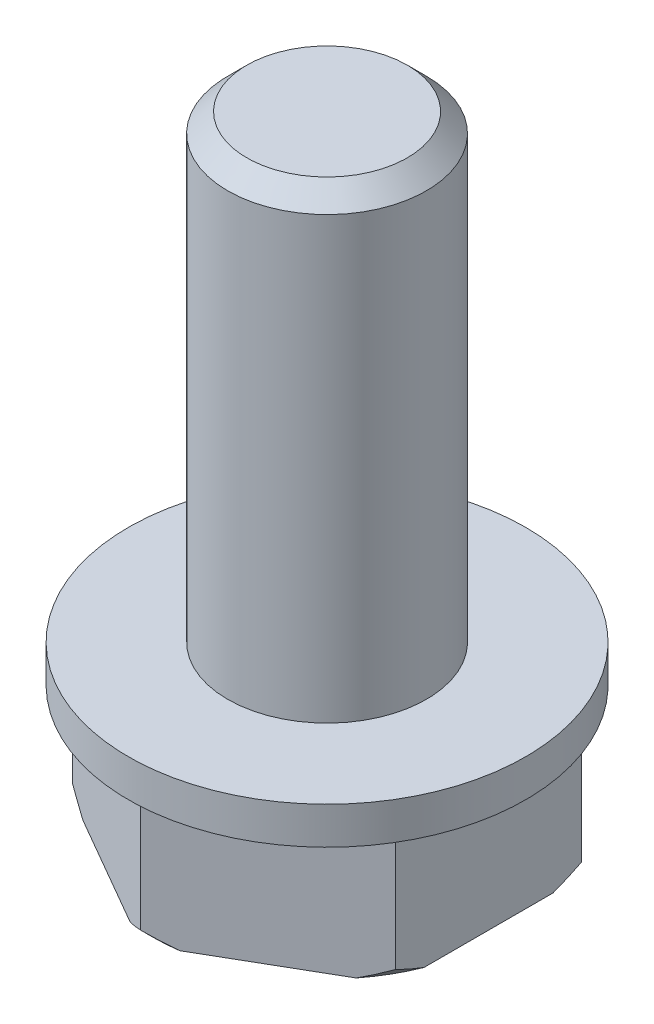
ISO-10303-21;
HEADER;
FILE_DESCRIPTION(('STEP AP214'),'2;1');
FILE_NAME('part.step','',(''),(''),'','','');
FILE_SCHEMA(('AUTOMOTIVE_DESIGN { 1 0 10303 214 1 1 1 1 }'));
ENDSEC;
DATA;
#1=APPLICATION_CONTEXT('core data for automotive mechanical design processes');
#2=APPLICATION_PROTOCOL_DEFINITION('international standard','automotive_design',2000,#1);
#3=PRODUCT_CONTEXT('',#1,'mechanical');
#4=PRODUCT('Part','Part','',(#3));
#5=PRODUCT_RELATED_PRODUCT_CATEGORY('part','',(#4));
#6=PRODUCT_DEFINITION_FORMATION('','',#4);
#7=PRODUCT_DEFINITION_CONTEXT('part definition',#1,'design');
#8=PRODUCT_DEFINITION('design','',#6,#7);
#9=PRODUCT_DEFINITION_SHAPE('','',#8);
#10=(LENGTH_UNIT() NAMED_UNIT(*) SI_UNIT(.MILLI.,.METRE.));
#11=(NAMED_UNIT(*) PLANE_ANGLE_UNIT() SI_UNIT($,.RADIAN.));
#12=(NAMED_UNIT(*) SI_UNIT($,.STERADIAN.) SOLID_ANGLE_UNIT());
#13=UNCERTAINTY_MEASURE_WITH_UNIT(LENGTH_MEASURE(1.E-05),#10,'distance_accuracy_value','');
#14=(GEOMETRIC_REPRESENTATION_CONTEXT(3) GLOBAL_UNCERTAINTY_ASSIGNED_CONTEXT((#13)) GLOBAL_UNIT_ASSIGNED_CONTEXT((#10,
#11,#12)) REPRESENTATION_CONTEXT('',''));
#15=CARTESIAN_POINT('',(0.,0.,0.));
#16=DIRECTION('',(0.,0.,1.));
#17=DIRECTION('',(1.,0.,0.));
#18=AXIS2_PLACEMENT_3D('',#15,#16,#17);
#19=CARTESIAN_POINT('',(31.2487373415292,113.4,20.9959605917966));
#20=DIRECTION('',(-0.5,0.,0.866025403784439));
#21=DIRECTION('',(0.866025403784439,0.,0.5));
#22=AXIS2_PLACEMENT_3D('',#19,#20,#21);
#23=PLANE('',#22);
#24=DIRECTION('',(0.,-1.,0.));
#25=VECTOR('',#24,1.);
#26=CARTESIAN_POINT('',(31.2487373415292,113.4,20.9959605917966));
#27=LINE('',#26,#25);
#28=CARTESIAN_POINT('',(31.2487373415292,68.7,20.9959605917966));
#29=VERTEX_POINT('',#28);
#30=CARTESIAN_POINT('',(31.2487373415292,63.9055534994651,20.9959605917966));
#31=VERTEX_POINT('',#30);
#32=EDGE_CURVE('E11',#29,#31,#27,.T.);
#33=ORIENTED_EDGE('',*,*,#32,.T.);
#34=CARTESIAN_POINT('',(30.2487373415292,63.4,20.418610322607));
#35=CARTESIAN_POINT('',(30.2898871786535,63.4176356350764,20.4423683487996));
#36=CARTESIAN_POINT('',(30.3309185698522,63.4356367332046,20.466059223998));
#37=CARTESIAN_POINT('',(30.4131261080462,63.4725093452912,20.5135255035906));
#38=CARTESIAN_POINT('',(30.4543000527066,63.491387396993,20.5372996452214));
#39=CARTESIAN_POINT('',(30.5368134585381,63.5300136187559,20.58494289067));
#40=CARTESIAN_POINT('',(30.5781505543364,63.5497685285904,20.6088106227115));
#41=CARTESIAN_POINT('',(30.6610101371074,63.5901483001101,20.6566518801523));
#42=CARTESIAN_POINT('',(30.7025301099427,63.6107800529027,20.6806239409595));
#43=CARTESIAN_POINT('',(30.7857742143479,63.6529133663717,20.7286845680958));
#44=CARTESIAN_POINT('',(30.8274956955541,63.6744219220571,20.7527715894061));
#45=CARTESIAN_POINT('',(30.9111605932301,63.7183087773034,20.8010727907276));
#46=CARTESIAN_POINT('',(30.9531012369611,63.7406941334488,20.8252853590476));
#47=CARTESIAN_POINT('',(31.037221231282,63.7863344571394,20.8738481173586));
#48=CARTESIAN_POINT('',(31.0793977002766,63.8095965033679,20.8981966416392));
#49=CARTESIAN_POINT('',(31.164005290327,63.8569905234084,20.9470416600006));
#50=CARTESIAN_POINT('',(31.2064334361144,63.8811295690813,20.9715364479081));
#51=CARTESIAN_POINT('',(31.2487373415291,63.9055534994651,20.9959605917966));
#52=B_SPLINE_CURVE_WITH_KNOTS('',3,(#34,#35,#36,#37,#38,#39,#40,#41,#42,#43,#44,#45,#46,#47,#48,
#49,#50,#51),.UNSPECIFIED.,.F.,.F.,(4,2,2,2,2,2,2,2,4),(0.,0.15204686609259,0.305507708751331,
0.460480357340248,0.617058082843109,0.775329645183755,0.93537936156832,1.0972871929665,
1.26112884592903),.UNSPECIFIED.);
#53=CARTESIAN_POINT('',(30.2487373415292,63.4,20.4186103226069));
#54=VERTEX_POINT('',#53);
#55=EDGE_CURVE('E89',#54,#31,#52,.T.);
#56=ORIENTED_EDGE('',*,*,#55,.F.);
#57=DIRECTION('',(0.866025403784439,0.,0.5));
#58=VECTOR('',#57,1.);
#59=CARTESIAN_POINT('',(33.2487373415291,63.4,22.1506611301759));
#60=LINE('',#59,#58);
#61=CARTESIAN_POINT('',(25.7487373415292,63.4,17.8205341112537));
#62=VERTEX_POINT('',#61);
#63=EDGE_CURVE('E230',#62,#54,#60,.T.);
#64=ORIENTED_EDGE('',*,*,#63,.F.);
#65=CARTESIAN_POINT('',(24.7487373415291,63.9055534994651,17.243183842064));
#66=CARTESIAN_POINT('',(24.7910412233096,63.8811295690813,17.2676080268882));
#67=CARTESIAN_POINT('',(24.8334684047916,63.8569905234084,17.2921044850218));
#68=CARTESIAN_POINT('',(24.9180732265661,63.8095965033679,17.3409542981778));
#69=CARTESIAN_POINT('',(24.9602479016351,63.7863344571393,17.3653059296288));
#70=CARTESIAN_POINT('',(25.0443644811706,63.7406941334488,17.4138746025213));
#71=CARTESIAN_POINT('',(25.0863035022922,63.7183087773034,17.4380899812835));
#72=CARTESIAN_POINT('',(25.1699660185079,63.674421922057,17.4863953074152));
#73=CARTESIAN_POINT('',(25.2116867314672,63.6529133663717,17.5104836593681));
#74=CARTESIAN_POINT('',(25.2949305076916,63.6107800529027,17.5585448549301));
#75=CARTESIAN_POINT('',(25.3364509077494,63.5901483001101,17.5825161757663));
#76=CARTESIAN_POINT('',(25.4193124434277,63.5497685285904,17.6303540506726));
#77=CARTESIAN_POINT('',(25.4606510536055,63.5300136187559,17.6542191597318));
#78=CARTESIAN_POINT('',(25.5431680173984,63.4913873969929,17.7018562426104));
#79=CARTESIAN_POINT('',(25.584344000334,63.4725093452912,17.7256268538449));
#80=CARTESIAN_POINT('',(25.6665547733813,63.4356367332046,17.7730875305072));
#81=CARTESIAN_POINT('',(25.7075873687404,63.4176356350764,17.7967763200387));
#82=CARTESIAN_POINT('',(25.7487373415291,63.4,17.8205341112537));
#83=B_SPLINE_CURVE_WITH_KNOTS('',3,(#65,#66,#67,#68,#69,#70,#71,#72,#73,#74,#75,#76,#77,#78,#79,
#80,#81,#82),.UNSPECIFIED.,.F.,.F.,(4,2,2,2,2,2,2,2,4),(0.,0.163841652962564,0.325749484360772,
0.485799200745352,0.644070763086002,0.800648488588861,0.955621137177764,1.10908197983649,
1.26112884592904),.UNSPECIFIED.);
#84=CARTESIAN_POINT('',(24.7487373415292,63.9055534994651,17.243183842064));
#85=VERTEX_POINT('',#84);
#86=EDGE_CURVE('E130',#85,#62,#83,.T.);
#87=ORIENTED_EDGE('',*,*,#86,.F.);
#88=DIRECTION('',(0.,-1.,0.));
#89=VECTOR('',#88,1.);
#90=CARTESIAN_POINT('',(24.7487373415292,113.4,17.243183842064));
#91=LINE('',#90,#89);
#92=CARTESIAN_POINT('',(24.7487373415292,68.7,17.243183842064));
#93=VERTEX_POINT('',#92);
#94=EDGE_CURVE('E215',#93,#85,#91,.T.);
#95=ORIENTED_EDGE('',*,*,#94,.F.);
#96=DIRECTION('',(-0.866025403784439,0.,-0.5));
#97=VECTOR('',#96,1.);
#98=CARTESIAN_POINT('',(30.9987373415292,68.7,20.8516230244992));
#99=LINE('',#98,#97);
#100=EDGE_CURVE('E134',#29,#93,#99,.T.);
#101=ORIENTED_EDGE('',*,*,#100,.F.);
#102=EDGE_LOOP('',(#33,#56,#64,#87,#95,#101));
#103=FACE_BOUND('',#102,.T.);
#104=ADVANCED_FACE('F16',(#103),#23,.F.);
#105=CARTESIAN_POINT('',(31.2487373415292,113.4,28.5015140912618));
#106=DIRECTION('',(-1.,0.,0.));
#107=DIRECTION('',(0.,0.,1.));
#108=AXIS2_PLACEMENT_3D('',#105,#106,#107);
#109=PLANE('',#108);
#110=DIRECTION('',(0.,-1.,0.));
#111=VECTOR('',#110,1.);
#112=CARTESIAN_POINT('',(31.2487373415292,113.4,28.5015140912618));
#113=LINE('',#112,#111);
#114=CARTESIAN_POINT('',(31.2487373415292,68.7,28.5015140912618));
#115=VERTEX_POINT('',#114);
#116=CARTESIAN_POINT('',(31.2487373415292,63.9055534994651,28.5015140912618));
#117=VERTEX_POINT('',#116);
#118=EDGE_CURVE('E126',#115,#117,#113,.T.);
#119=ORIENTED_EDGE('',*,*,#118,.T.);
#120=CARTESIAN_POINT('',(31.2487373415291,63.4,27.3468135528825));
#121=CARTESIAN_POINT('',(31.2487372058647,63.4176356350764,27.39432937029));
#122=CARTESIAN_POINT('',(31.2487360017043,63.4356367332046,27.4417090350199));
#123=CARTESIAN_POINT('',(31.248732766851,63.4725093452911,27.5366359912748));
#124=CARTESIAN_POINT('',(31.2487307285758,63.4913873969929,27.5841807441401));
#125=CARTESIAN_POINT('',(31.2487271706144,63.5300136187559,27.6794610724672));
#126=CARTESIAN_POINT('',(31.2487256562348,63.5497685285904,27.727193913568));
#127=CARTESIAN_POINT('',(31.2487237033276,63.59014830011,27.8228730459151));
#128=CARTESIAN_POINT('',(31.2487232761051,63.6107800529026,27.8708164275585));
#129=CARTESIAN_POINT('',(31.2487236042859,63.6529133663716,27.9669382502568));
#130=CARTESIAN_POINT('',(31.2487243725327,63.674421922057,28.01511362352));
#131=CARTESIAN_POINT('',(31.248726753993,63.7183087773034,28.1117201509732));
#132=CARTESIAN_POINT('',(31.2487283766026,63.7406941334487,28.1601480980554));
#133=CARTESIAN_POINT('',(31.2487317913879,63.7863344571393,28.2572795292589));
#134=CARTESIAN_POINT('',(31.2487335853135,63.8095965033678,28.3059796849905));
#135=CARTESIAN_POINT('',(31.2487363535894,63.8569905234084,28.4036745165079));
#136=CARTESIAN_POINT('',(31.2487373178949,63.8811295690813,28.452665762549));
#137=CARTESIAN_POINT('',(31.2487373415292,63.9055534994651,28.5015140912617));
#138=B_SPLINE_CURVE_WITH_KNOTS('',3,(#120,#121,#122,#123,#124,#125,#126,#127,#128,#129,#130,
#131,#132,#133,#134,#135,#136,#137),.UNSPECIFIED.,.F.,.F.,(4,2,2,2,2,2,2,2,4),(0.,
0.152046866092544,0.30550770875125,0.460480357340149,0.617058082843005,0.775329645183666,
0.935379361568245,1.09728719296646,1.26112884592904),.UNSPECIFIED.);
#139=CARTESIAN_POINT('',(31.2487373415292,63.4,27.3468135528825));
#140=VERTEX_POINT('',#139);
#141=EDGE_CURVE('E29',#140,#117,#138,.T.);
#142=ORIENTED_EDGE('',*,*,#141,.F.);
#143=DIRECTION('',(0.,0.,1.));
#144=VECTOR('',#143,1.);
#145=CARTESIAN_POINT('',(31.2487373415292,63.4,24.7487373415292));
#146=LINE('',#145,#144);
#147=CARTESIAN_POINT('',(31.2487373415292,63.4,22.1506611301759));
#148=VERTEX_POINT('',#147);
#149=EDGE_CURVE('E467',#148,#140,#146,.T.);
#150=ORIENTED_EDGE('',*,*,#149,.F.);
#151=CARTESIAN_POINT('',(31.2487373415292,63.9055534994651,20.9959605917966));
#152=CARTESIAN_POINT('',(31.2487373415292,63.7175987189877,21.3718701527514));
#153=CARTESIAN_POINT('',(31.2487373415292,63.5456736196058,21.7581725138741));
#154=CARTESIAN_POINT('',(31.2487373415292,63.4,22.1506611301759));
#155=(BOUNDED_CURVE() B_SPLINE_CURVE(3,(#151,#152,#153,#154),.UNSPECIFIED.,.F.,
.F.) B_SPLINE_CURVE_WITH_KNOTS((4,4),(0.00544471025563386,0.00669711306648936),
.UNSPECIFIED.) CURVE() GEOMETRIC_REPRESENTATION_ITEM() RATIONAL_B_SPLINE_CURVE((1.,1.,1.,1.)) REPRESENTATION_ITEM(''));
#156=EDGE_CURVE('E94',#31,#148,#155,.T.);
#157=ORIENTED_EDGE('',*,*,#156,.F.);
#158=ORIENTED_EDGE('',*,*,#32,.F.);
#159=DIRECTION('',(0.,0.,-1.));
#160=VECTOR('',#159,1.);
#161=CARTESIAN_POINT('',(31.2487373415292,68.7,24.7487373415292));
#162=LINE('',#161,#160);
#163=EDGE_CURVE('E115',#115,#29,#162,.T.);
#164=ORIENTED_EDGE('',*,*,#163,.F.);
#165=EDGE_LOOP('',(#119,#142,#150,#157,#158,#164));
#166=FACE_BOUND('',#165,.T.);
#167=ADVANCED_FACE('F151',(#166),#109,.F.);
#168=CARTESIAN_POINT('',(24.7487373415292,64.2,24.7487373415292));
#169=DIRECTION('',(0.,1.,0.));
#170=DIRECTION('',(0.,0.,1.));
#171=AXIS2_PLACEMENT_3D('',#168,#169,#170);
#172=CONICAL_SURFACE('',#171,7.8,0.785398163397448);
#173=CARTESIAN_POINT('',(24.7487373415292,63.4,24.7487373415292));
#174=DIRECTION('',(0.,-1.,0.));
#175=DIRECTION('',(0.,0.,-1.));
#176=AXIS2_PLACEMENT_3D('',#173,#174,#175);
#177=CIRCLE('',#176,7.);
#178=CARTESIAN_POINT('',(30.2487373415292,63.4,29.0788643604513));
#179=VERTEX_POINT('',#178);
#180=EDGE_CURVE('E341',#140,#179,#177,.T.);
#181=ORIENTED_EDGE('',*,*,#180,.F.);
#182=ORIENTED_EDGE('',*,*,#141,.T.);
#183=CARTESIAN_POINT('',(31.2487373415292,63.9055534994651,28.5015140912617));
#184=CARTESIAN_POINT('',(31.2064334361144,63.8811295690813,28.5259382351502));
#185=CARTESIAN_POINT('',(31.164005290327,63.8569905234084,28.5504330230577));
#186=CARTESIAN_POINT('',(31.0793977002765,63.8095965033679,28.5992780414191));
#187=CARTESIAN_POINT('',(31.0372212312819,63.7863344571393,28.6236265656998));
#188=CARTESIAN_POINT('',(30.9531012369611,63.7406941334488,28.6721893240107));
#189=CARTESIAN_POINT('',(30.91116059323,63.7183087773034,28.6964018923307));
#190=CARTESIAN_POINT('',(30.827495695554,63.6744219220571,28.7447030936522));
#191=CARTESIAN_POINT('',(30.7857742143479,63.6529133663717,28.7687901149626));
#192=CARTESIAN_POINT('',(30.7025301099427,63.6107800529027,28.8168507420988));
#193=CARTESIAN_POINT('',(30.6610101371074,63.5901483001101,28.840822802906));
#194=CARTESIAN_POINT('',(30.5781505543364,63.5497685285904,28.8886640603469));
#195=CARTESIAN_POINT('',(30.5368134585381,63.5300136187559,28.9125317923884));
#196=CARTESIAN_POINT('',(30.4543000527066,63.4913873969929,28.9601750378369));
#197=CARTESIAN_POINT('',(30.4131261080462,63.4725093452912,28.9839491794677));
#198=CARTESIAN_POINT('',(30.3309185698522,63.4356367332046,29.0314154590603));
#199=CARTESIAN_POINT('',(30.2898871786535,63.4176356350764,29.0551063342587));
#200=CARTESIAN_POINT('',(30.2487373415291,63.4,29.0788643604513));
#201=B_SPLINE_CURVE_WITH_KNOTS('',3,(#183,#184,#185,#186,#187,#188,#189,#190,#191,#192,#193,
#194,#195,#196,#197,#198,#199,#200),.UNSPECIFIED.,.F.,.F.,(4,2,2,2,2,2,2,2,4),(0.,
0.163841652962557,0.325749484360758,0.485799200745325,0.644070763085983,0.800648488588845,
0.955621137177753,1.10908197983648,1.26112884592904),.UNSPECIFIED.);
#202=EDGE_CURVE('E172',#117,#179,#201,.T.);
#203=ORIENTED_EDGE('',*,*,#202,.T.);
#204=EDGE_LOOP('',(#181,#182,#203));
#205=FACE_BOUND('',#204,.T.);
#206=ADVANCED_FACE('F142',(#205),#172,.T.);
#207=CARTESIAN_POINT('',(24.7487373415292,64.2,24.7487373415292));
#208=DIRECTION('',(0.,1.,0.));
#209=DIRECTION('',(0.,0.,1.));
#210=AXIS2_PLACEMENT_3D('',#207,#208,#209);
#211=CONICAL_SURFACE('',#210,7.8,0.785398163397448);
#212=CARTESIAN_POINT('',(24.7487373415292,63.4,24.7487373415292));
#213=DIRECTION('',(0.,-1.,0.));
#214=DIRECTION('',(0.,0.,-1.));
#215=AXIS2_PLACEMENT_3D('',#212,#213,#214);
#216=CIRCLE('',#215,7.);
#217=EDGE_CURVE('E465',#54,#148,#216,.T.);
#218=ORIENTED_EDGE('',*,*,#217,.F.);
#219=ORIENTED_EDGE('',*,*,#55,.T.);
#220=ORIENTED_EDGE('',*,*,#156,.T.);
#221=EDGE_LOOP('',(#218,#219,#220));
#222=FACE_BOUND('',#221,.T.);
#223=ADVANCED_FACE('F18',(#222),#211,.T.);
#224=CARTESIAN_POINT('',(24.7487373415292,64.2,24.7487373415292));
#225=DIRECTION('',(0.,1.,0.));
#226=DIRECTION('',(0.,0.,1.));
#227=AXIS2_PLACEMENT_3D('',#224,#225,#226);
#228=CONICAL_SURFACE('',#227,7.8,0.785398163397448);
#229=CARTESIAN_POINT('',(24.7487373415292,63.4,24.7487373415292));
#230=DIRECTION('',(0.,-1.,0.));
#231=DIRECTION('',(0.,0.,-1.));
#232=AXIS2_PLACEMENT_3D('',#229,#230,#231);
#233=CIRCLE('',#232,7.);
#234=CARTESIAN_POINT('',(23.7487373415292,63.4,17.8205341112537));
#235=VERTEX_POINT('',#234);
#236=EDGE_CURVE('E227',#235,#62,#233,.T.);
#237=ORIENTED_EDGE('',*,*,#236,.F.);
#238=CARTESIAN_POINT('',(23.7487373415291,63.4,17.8205341112537));
#239=CARTESIAN_POINT('',(23.7898873143179,63.4176356350764,17.7967763200387));
#240=CARTESIAN_POINT('',(23.830919909677,63.4356367332046,17.7730875305072));
#241=CARTESIAN_POINT('',(23.9131306827244,63.4725093452912,17.7256268538449));
#242=CARTESIAN_POINT('',(23.95430666566,63.491387396993,17.7018562426104));
#243=CARTESIAN_POINT('',(24.0368236294529,63.5300136187559,17.6542191597318));
#244=CARTESIAN_POINT('',(24.0781622396307,63.5497685285904,17.6303540506726));
#245=CARTESIAN_POINT('',(24.161023775309,63.5901483001101,17.5825161757663));
#246=CARTESIAN_POINT('',(24.2025441753667,63.6107800529027,17.5585448549301));
#247=CARTESIAN_POINT('',(24.2857879515911,63.6529133663717,17.510483659368));
#248=CARTESIAN_POINT('',(24.3275086645505,63.6744219220571,17.4863953074152));
#249=CARTESIAN_POINT('',(24.4111711807662,63.7183087773034,17.4380899812835));
#250=CARTESIAN_POINT('',(24.4531102018877,63.7406941334488,17.4138746025213));
#251=CARTESIAN_POINT('',(24.5372267814232,63.7863344571394,17.3653059296287));
#252=CARTESIAN_POINT('',(24.5794014564922,63.8095965033679,17.3409542981778));
#253=CARTESIAN_POINT('',(24.6640062782668,63.8569905234084,17.2921044850218));
#254=CARTESIAN_POINT('',(24.7064334597487,63.8811295690813,17.2676080268882));
#255=CARTESIAN_POINT('',(24.7487373415292,63.9055534994651,17.243183842064));
#256=B_SPLINE_CURVE_WITH_KNOTS('',3,(#238,#239,#240,#241,#242,#243,#244,#245,#246,#247,#248,
#249,#250,#251,#252,#253,#254,#255),.UNSPECIFIED.,.F.,.F.,(4,2,2,2,2,2,2,2,4),(0.,
0.152046866092592,0.305507708751335,0.460480357340253,0.61705808284312,0.775329645183774,
0.93537936156834,1.09728719296653,1.26112884592906),.UNSPECIFIED.);
#257=EDGE_CURVE('E223',#235,#85,#256,.T.);
#258=ORIENTED_EDGE('',*,*,#257,.T.);
#259=ORIENTED_EDGE('',*,*,#86,.T.);
#260=EDGE_LOOP('',(#237,#258,#259));
#261=FACE_BOUND('',#260,.T.);
#262=ADVANCED_FACE('F418',(#261),#228,.T.);
#263=CARTESIAN_POINT('',(24.7487373415292,70.2,24.7487373415292));
#264=DIRECTION('',(0.,-1.,0.));
#265=DIRECTION('',(0.,0.,-1.));
#266=AXIS2_PLACEMENT_3D('',#263,#264,#265);
#267=PLANE('',#266);
#268=CARTESIAN_POINT('',(24.7487373415292,70.2,24.7487373415292));
#269=DIRECTION('',(0.,-1.,0.));
#270=DIRECTION('',(0.,0.,-1.));
#271=AXIS2_PLACEMENT_3D('',#268,#269,#270);
#272=CIRCLE('',#271,4.);
#273=CARTESIAN_POINT('',(24.7487373415292,70.2,20.7487373415292));
#274=VERTEX_POINT('',#273);
#275=EDGE_CURVE('E113',#274,#274,#272,.T.);
#276=ORIENTED_EDGE('',*,*,#275,.T.);
#277=EDGE_LOOP('',(#276));
#278=FACE_BOUND('',#277,.T.);
#279=CARTESIAN_POINT('',(24.7487373415292,70.2,24.7487373415292));
#280=DIRECTION('',(0.,-1.,0.));
#281=DIRECTION('',(0.,0.,-1.));
#282=AXIS2_PLACEMENT_3D('',#279,#280,#281);
#283=CIRCLE('',#282,8.);
#284=CARTESIAN_POINT('',(24.7487373415292,70.2,16.7487373415292));
#285=VERTEX_POINT('',#284);
#286=EDGE_CURVE('E128',#285,#285,#283,.T.);
#287=ORIENTED_EDGE('',*,*,#286,.F.);
#288=EDGE_LOOP('',(#287));
#289=FACE_BOUND('',#288,.T.);
#290=ADVANCED_FACE('F254',(#278,#289),#267,.F.);
#291=CARTESIAN_POINT('',(24.7487373415292,64.2,24.7487373415292));
#292=DIRECTION('',(0.,1.,0.));
#293=DIRECTION('',(0.,0.,1.));
#294=AXIS2_PLACEMENT_3D('',#291,#292,#293);
#295=CONICAL_SURFACE('',#294,7.8,0.785398163397448);
#296=CARTESIAN_POINT('',(24.7487373415292,63.4,24.7487373415292));
#297=DIRECTION('',(0.,-1.,0.));
#298=DIRECTION('',(0.,0.,-1.));
#299=AXIS2_PLACEMENT_3D('',#296,#297,#298);
#300=CIRCLE('',#299,7.);
#301=CARTESIAN_POINT('',(18.2487373415292,63.4,22.1506611301759));
#302=VERTEX_POINT('',#301);
#303=CARTESIAN_POINT('',(19.2487373415291,63.4,20.4186103226069));
#304=VERTEX_POINT('',#303);
#305=EDGE_CURVE('E286',#302,#304,#300,.T.);
#306=ORIENTED_EDGE('',*,*,#305,.F.);
#307=CARTESIAN_POINT('',(18.2487373415292,63.4,22.1506611301758));
#308=CARTESIAN_POINT('',(18.2487374771936,63.4176356350764,22.1031453127683));
#309=CARTESIAN_POINT('',(18.248738681354,63.4356367332046,22.0557656480384));
#310=CARTESIAN_POINT('',(18.2487419162073,63.4725093452912,21.9608386917834));
#311=CARTESIAN_POINT('',(18.2487439544825,63.4913873969929,21.9132939389182));
#312=CARTESIAN_POINT('',(18.2487475124439,63.5300136187559,21.8180136105911));
#313=CARTESIAN_POINT('',(18.2487490268234,63.5497685285904,21.7702807694903));
#314=CARTESIAN_POINT('',(18.2487509797307,63.5901483001101,21.6746016371432));
#315=CARTESIAN_POINT('',(18.2487514069532,63.6107800529027,21.6266582554998));
#316=CARTESIAN_POINT('',(18.2487510787723,63.6529133663717,21.5305364328015));
#317=CARTESIAN_POINT('',(18.2487503105256,63.674421922057,21.4823610595383));
#318=CARTESIAN_POINT('',(18.2487479290653,63.7183087773034,21.3857545320851));
#319=CARTESIAN_POINT('',(18.2487463064557,63.7406941334488,21.3373265850029));
#320=CARTESIAN_POINT('',(18.2487428916704,63.7863344571394,21.2401951537994));
#321=CARTESIAN_POINT('',(18.2487410977448,63.8095965033679,21.1914949980678));
#322=CARTESIAN_POINT('',(18.2487383294689,63.8569905234084,21.0938001665504));
#323=CARTESIAN_POINT('',(18.2487373651634,63.8811295690813,21.0448089205093));
#324=CARTESIAN_POINT('',(18.2487373415292,63.9055534994651,20.9959605917966));
#325=B_SPLINE_CURVE_WITH_KNOTS('',3,(#307,#308,#309,#310,#311,#312,#313,#314,#315,#316,#317,
#318,#319,#320,#321,#322,#323,#324),.UNSPECIFIED.,.F.,.F.,(4,2,2,2,2,2,2,2,4),(0.,
0.152046866092554,0.305507708751278,0.460480357340183,0.617058082843039,0.775329645183694,
0.935379361568264,1.09728719296648,1.26112884592904),.UNSPECIFIED.);
#326=CARTESIAN_POINT('',(18.2487373415292,63.9055534994651,20.9959605917966));
#327=VERTEX_POINT('',#326);
#328=EDGE_CURVE('E224',#302,#327,#325,.T.);
#329=ORIENTED_EDGE('',*,*,#328,.T.);
#330=CARTESIAN_POINT('',(18.2487373415292,63.9055534994651,20.9959605917966));
#331=CARTESIAN_POINT('',(18.2910412469439,63.8811295690813,20.9715364479081));
#332=CARTESIAN_POINT('',(18.3334693927313,63.8569905234084,20.9470416600005));
#333=CARTESIAN_POINT('',(18.4180769827818,63.8095965033679,20.8981966416392));
#334=CARTESIAN_POINT('',(18.4602534517764,63.7863344571393,20.8738481173585));
#335=CARTESIAN_POINT('',(18.5443734460972,63.7406941334488,20.8252853590476));
#336=CARTESIAN_POINT('',(18.5863140898283,63.7183087773034,20.8010727907276));
#337=CARTESIAN_POINT('',(18.6699789875043,63.674421922057,20.7527715894061));
#338=CARTESIAN_POINT('',(18.7117004687104,63.6529133663717,20.7286845680957));
#339=CARTESIAN_POINT('',(18.7949445731156,63.6107800529027,20.6806239409595));
#340=CARTESIAN_POINT('',(18.8364645459509,63.5901483001101,20.6566518801523));
#341=CARTESIAN_POINT('',(18.919324128722,63.5497685285904,20.6088106227114));
#342=CARTESIAN_POINT('',(18.9606612245202,63.5300136187559,20.5849428906699));
#343=CARTESIAN_POINT('',(19.0431746303517,63.4913873969929,20.5372996452214));
#344=CARTESIAN_POINT('',(19.0843485750121,63.4725093452912,20.5135255035906));
#345=CARTESIAN_POINT('',(19.1665561132061,63.4356367332046,20.466059223998));
#346=CARTESIAN_POINT('',(19.2075875044049,63.4176356350764,20.4423683487996));
#347=CARTESIAN_POINT('',(19.2487373415292,63.4,20.418610322607));
#348=B_SPLINE_CURVE_WITH_KNOTS('',3,(#330,#331,#332,#333,#334,#335,#336,#337,#338,#339,#340,
#341,#342,#343,#344,#345,#346,#347),.UNSPECIFIED.,.F.,.F.,(4,2,2,2,2,2,2,2,4),(0.,
0.163841652962558,0.325749484360757,0.485799200745332,0.644070763085981,0.800648488588842,
0.955621137177748,1.10908197983647,1.26112884592904),.UNSPECIFIED.);
#349=EDGE_CURVE('E131',#327,#304,#348,.T.);
#350=ORIENTED_EDGE('',*,*,#349,.T.);
#351=EDGE_LOOP('',(#306,#329,#350));
#352=FACE_BOUND('',#351,.T.);
#353=ADVANCED_FACE('F196',(#352),#295,.T.);
#354=CARTESIAN_POINT('',(24.7487373415292,68.7,24.7487373415292));
#355=DIRECTION('',(0.,-1.,0.));
#356=DIRECTION('',(0.,0.,-1.));
#357=AXIS2_PLACEMENT_3D('',#354,#355,#356);
#358=CYLINDRICAL_SURFACE('',#357,8.);
#359=ORIENTED_EDGE('',*,*,#286,.T.);
#360=EDGE_LOOP('',(#359));
#361=FACE_BOUND('',#360,.T.);
#362=CARTESIAN_POINT('',(24.7487373415292,68.7,24.7487373415292));
#363=DIRECTION('',(0.,-1.,0.));
#364=DIRECTION('',(0.,0.,-1.));
#365=AXIS2_PLACEMENT_3D('',#362,#363,#364);
#366=CIRCLE('',#365,8.);
#367=CARTESIAN_POINT('',(24.7487373415292,68.7,16.7487373415292));
#368=VERTEX_POINT('',#367);
#369=EDGE_CURVE('E121',#368,#368,#366,.T.);
#370=ORIENTED_EDGE('',*,*,#369,.F.);
#371=EDGE_LOOP('',(#370));
#372=FACE_BOUND('',#371,.T.);
#373=ADVANCED_FACE('F191',(#361,#372),#358,.T.);
#374=CARTESIAN_POINT('',(24.7487373415292,113.4,17.243183842064));
#375=DIRECTION('',(0.5,0.,0.866025403784439));
#376=DIRECTION('',(0.866025403784439,0.,-0.5));
#377=AXIS2_PLACEMENT_3D('',#374,#375,#376);
#378=PLANE('',#377);
#379=ORIENTED_EDGE('',*,*,#94,.T.);
#380=ORIENTED_EDGE('',*,*,#257,.F.);
#381=DIRECTION('',(0.866025403784439,0.,-0.5));
#382=VECTOR('',#381,1.);
#383=CARTESIAN_POINT('',(26.7487373415292,63.4,16.0884833036848));
#384=LINE('',#383,#382);
#385=EDGE_CURVE('E231',#304,#235,#384,.T.);
#386=ORIENTED_EDGE('',*,*,#385,.F.);
#387=ORIENTED_EDGE('',*,*,#349,.F.);
#388=DIRECTION('',(0.,-1.,0.));
#389=VECTOR('',#388,1.);
#390=CARTESIAN_POINT('',(18.2487373415292,113.4,20.9959605917966));
#391=LINE('',#390,#389);
#392=CARTESIAN_POINT('',(18.2487373415292,68.7,20.9959605917966));
#393=VERTEX_POINT('',#392);
#394=EDGE_CURVE('E425',#393,#327,#391,.T.);
#395=ORIENTED_EDGE('',*,*,#394,.F.);
#396=DIRECTION('',(-0.866025403784439,0.,0.5));
#397=VECTOR('',#396,1.);
#398=CARTESIAN_POINT('',(24.4987373415292,68.7,17.3875214093615));
#399=LINE('',#398,#397);
#400=EDGE_CURVE('E424',#93,#393,#399,.T.);
#401=ORIENTED_EDGE('',*,*,#400,.F.);
#402=EDGE_LOOP('',(#379,#380,#386,#387,#395,#401));
#403=FACE_BOUND('',#402,.T.);
#404=ADVANCED_FACE('F195',(#403),#378,.F.);
#405=CARTESIAN_POINT('',(18.2487373415292,113.4,20.9959605917966));
#406=DIRECTION('',(1.,0.,0.));
#407=DIRECTION('',(0.,0.,-1.));
#408=AXIS2_PLACEMENT_3D('',#405,#406,#407);
#409=PLANE('',#408);
#410=ORIENTED_EDGE('',*,*,#394,.T.);
#411=ORIENTED_EDGE('',*,*,#328,.F.);
#412=DIRECTION('',(0.,0.,-1.));
#413=VECTOR('',#412,1.);
#414=CARTESIAN_POINT('',(18.2487373415292,63.4,24.7487373415292));
#415=LINE('',#414,#413);
#416=CARTESIAN_POINT('',(18.2487373415292,63.4,27.3468135528825));
#417=VERTEX_POINT('',#416);
#418=EDGE_CURVE('E278',#417,#302,#415,.T.);
#419=ORIENTED_EDGE('',*,*,#418,.F.);
#420=CARTESIAN_POINT('',(18.2487373415292,63.9055534994651,28.5015140912618));
#421=CARTESIAN_POINT('',(18.2487373415292,63.7175987189877,28.125604530307));
#422=CARTESIAN_POINT('',(18.2487373415292,63.5456736196058,27.7393021691841));
#423=CARTESIAN_POINT('',(18.2487373415292,63.4,27.3468135528825));
#424=(BOUNDED_CURVE() B_SPLINE_CURVE(3,(#420,#421,#422,#423),.UNSPECIFIED.,.F.,
.F.) B_SPLINE_CURVE_WITH_KNOTS((4,4),(0.00544471025563386,0.00669711306648936),
.UNSPECIFIED.) CURVE() GEOMETRIC_REPRESENTATION_ITEM() RATIONAL_B_SPLINE_CURVE((1.,1.,1.,1.)) REPRESENTATION_ITEM(''));
#425=CARTESIAN_POINT('',(18.2487373415292,63.9055534994651,28.5015140912618));
#426=VERTEX_POINT('',#425);
#427=EDGE_CURVE('E117',#426,#417,#424,.T.);
#428=ORIENTED_EDGE('',*,*,#427,.F.);
#429=DIRECTION('',(0.,-1.,0.));
#430=VECTOR('',#429,1.);
#431=CARTESIAN_POINT('',(18.2487373415292,113.4,28.5015140912618));
#432=LINE('',#431,#430);
#433=CARTESIAN_POINT('',(18.2487373415292,68.7,28.5015140912618));
#434=VERTEX_POINT('',#433);
#435=EDGE_CURVE('E125',#434,#426,#432,.T.);
#436=ORIENTED_EDGE('',*,*,#435,.F.);
#437=DIRECTION('',(0.,0.,1.));
#438=VECTOR('',#437,1.);
#439=CARTESIAN_POINT('',(18.2487373415292,68.7,24.7487373415292));
#440=LINE('',#439,#438);
#441=EDGE_CURVE('E398',#393,#434,#440,.T.);
#442=ORIENTED_EDGE('',*,*,#441,.F.);
#443=EDGE_LOOP('',(#410,#411,#419,#428,#436,#442));
#444=FACE_BOUND('',#443,.T.);
#445=ADVANCED_FACE('F152',(#444),#409,.F.);
#446=CARTESIAN_POINT('',(32.7487373415291,68.7,24.7487373415292));
#447=DIRECTION('',(0.,1.,0.));
#448=DIRECTION('',(0.,0.,1.));
#449=AXIS2_PLACEMENT_3D('',#446,#447,#448);
#450=PLANE('',#449);
#451=ORIENTED_EDGE('',*,*,#369,.T.);
#452=EDGE_LOOP('',(#451));
#453=FACE_BOUND('',#452,.T.);
#454=ORIENTED_EDGE('',*,*,#163,.T.);
#455=ORIENTED_EDGE('',*,*,#100,.T.);
#456=ORIENTED_EDGE('',*,*,#400,.T.);
#457=ORIENTED_EDGE('',*,*,#441,.T.);
#458=DIRECTION('',(0.866025403784439,0.,0.5));
#459=VECTOR('',#458,1.);
#460=CARTESIAN_POINT('',(24.4987373415292,68.7,32.1099532736969));
#461=LINE('',#460,#459);
#462=CARTESIAN_POINT('',(24.7487373415292,68.7,32.2542908409943));
#463=VERTEX_POINT('',#462);
#464=EDGE_CURVE('E429',#434,#463,#461,.T.);
#465=ORIENTED_EDGE('',*,*,#464,.T.);
#466=DIRECTION('',(0.866025403784439,0.,-0.5));
#467=VECTOR('',#466,1.);
#468=CARTESIAN_POINT('',(30.9987373415292,68.7,28.6458516585592));
#469=LINE('',#468,#467);
#470=EDGE_CURVE('E123',#463,#115,#469,.T.);
#471=ORIENTED_EDGE('',*,*,#470,.T.);
#472=EDGE_LOOP('',(#454,#455,#456,#457,#465,#471));
#473=FACE_BOUND('',#472,.T.);
#474=ADVANCED_FACE('F255',(#453,#473),#450,.F.);
#475=CARTESIAN_POINT('',(24.7487373415292,88.7,24.7487373415292));
#476=DIRECTION('',(0.,-1.,0.));
#477=DIRECTION('',(0.,0.,-1.));
#478=AXIS2_PLACEMENT_3D('',#475,#476,#477);
#479=CONICAL_SURFACE('',#478,3.233,0.78539816339745);
#480=CARTESIAN_POINT('',(24.7487373415292,88.7,24.7487373415292));
#481=DIRECTION('',(0.,-1.,0.));
#482=DIRECTION('',(0.,0.,-1.));
#483=AXIS2_PLACEMENT_3D('',#480,#481,#482);
#484=CIRCLE('',#483,3.233);
#485=CARTESIAN_POINT('',(24.7487373415292,88.7,21.5157373415292));
#486=VERTEX_POINT('',#485);
#487=EDGE_CURVE('E112',#486,#486,#484,.T.);
#488=ORIENTED_EDGE('',*,*,#487,.T.);
#489=EDGE_LOOP('',(#488));
#490=FACE_BOUND('',#489,.T.);
#491=CARTESIAN_POINT('',(24.7487373415292,87.933,24.7487373415292));
#492=DIRECTION('',(0.,-1.,0.));
#493=DIRECTION('',(0.,0.,-1.));
#494=AXIS2_PLACEMENT_3D('',#491,#492,#493);
#495=CIRCLE('',#494,4.);
#496=CARTESIAN_POINT('',(24.7487373415292,87.933,20.7487373415292));
#497=VERTEX_POINT('',#496);
#498=EDGE_CURVE('E108',#497,#497,#495,.T.);
#499=ORIENTED_EDGE('',*,*,#498,.F.);
#500=EDGE_LOOP('',(#499));
#501=FACE_BOUND('',#500,.T.);
#502=ADVANCED_FACE('F374',(#490,#501),#479,.T.);
#503=CARTESIAN_POINT('',(24.7487373415292,88.7,24.7487373415292));
#504=DIRECTION('',(0.,-1.,0.));
#505=DIRECTION('',(0.,0.,-1.));
#506=AXIS2_PLACEMENT_3D('',#503,#504,#505);
#507=PLANE('',#506);
#508=ORIENTED_EDGE('',*,*,#487,.F.);
#509=EDGE_LOOP('',(#508));
#510=FACE_BOUND('',#509,.T.);
#511=ADVANCED_FACE('F369',(#510),#507,.F.);
#512=CARTESIAN_POINT('',(24.7487373415292,63.4,24.7487373415292));
#513=DIRECTION('',(0.,-1.,0.));
#514=DIRECTION('',(0.,0.,-1.));
#515=AXIS2_PLACEMENT_3D('',#512,#513,#514);
#516=CYLINDRICAL_SURFACE('',#515,4.);
#517=ORIENTED_EDGE('',*,*,#498,.T.);
#518=EDGE_LOOP('',(#517));
#519=FACE_BOUND('',#518,.T.);
#520=ORIENTED_EDGE('',*,*,#275,.F.);
#521=EDGE_LOOP('',(#520));
#522=FACE_BOUND('',#521,.T.);
#523=ADVANCED_FACE('F109',(#519,#522),#516,.T.);
#524=CARTESIAN_POINT('',(24.7487373415292,64.2,24.7487373415292));
#525=DIRECTION('',(0.,1.,0.));
#526=DIRECTION('',(0.,0.,1.));
#527=AXIS2_PLACEMENT_3D('',#524,#525,#526);
#528=CONICAL_SURFACE('',#527,7.8,0.785398163397448);
#529=CARTESIAN_POINT('',(24.7487373415292,63.4,24.7487373415292));
#530=DIRECTION('',(0.,-1.,0.));
#531=DIRECTION('',(0.,0.,-1.));
#532=AXIS2_PLACEMENT_3D('',#529,#530,#531);
#533=CIRCLE('',#532,7.);
#534=CARTESIAN_POINT('',(25.7487373415292,63.4,31.6769405718047));
#535=VERTEX_POINT('',#534);
#536=CARTESIAN_POINT('',(23.7487373415292,63.4,31.6769405718047));
#537=VERTEX_POINT('',#536);
#538=EDGE_CURVE('E338',#535,#537,#533,.T.);
#539=ORIENTED_EDGE('',*,*,#538,.F.);
#540=CARTESIAN_POINT('',(25.7487373415292,63.4,31.6769405718047));
#541=CARTESIAN_POINT('',(25.7075873687404,63.4176356350764,31.7006983630196));
#542=CARTESIAN_POINT('',(25.6665547733813,63.4356367332046,31.7243871525511));
#543=CARTESIAN_POINT('',(25.5843440003339,63.4725093452912,31.7718478292134));
#544=CARTESIAN_POINT('',(25.5431680173983,63.4913873969929,31.7956184404479));
#545=CARTESIAN_POINT('',(25.4606510536054,63.5300136187559,31.8432555233265));
#546=CARTESIAN_POINT('',(25.4193124434276,63.5497685285904,31.8671206323857));
#547=CARTESIAN_POINT('',(25.3364509077494,63.5901483001101,31.914958507292));
#548=CARTESIAN_POINT('',(25.2949305076916,63.6107800529027,31.9389298281282));
#549=CARTESIAN_POINT('',(25.2116867314672,63.6529133663717,31.9869910236903));
#550=CARTESIAN_POINT('',(25.1699660185079,63.6744219220571,32.0110793756431));
#551=CARTESIAN_POINT('',(25.0863035022921,63.7183087773034,32.0593847017748));
#552=CARTESIAN_POINT('',(25.0443644811706,63.7406941334488,32.083600080537));
#553=CARTESIAN_POINT('',(24.9602479016351,63.7863344571393,32.1321687534296));
#554=CARTESIAN_POINT('',(24.9180732265661,63.8095965033679,32.1565203848805));
#555=CARTESIAN_POINT('',(24.8334684047916,63.8569905234084,32.2053701980365));
#556=CARTESIAN_POINT('',(24.7910412233096,63.8811295690813,32.2298666561701));
#557=CARTESIAN_POINT('',(24.7487373415292,63.9055534994651,32.2542908409943));
#558=B_SPLINE_CURVE_WITH_KNOTS('',3,(#540,#541,#542,#543,#544,#545,#546,#547,#548,#549,#550,
#551,#552,#553,#554,#555,#556,#557),.UNSPECIFIED.,.F.,.F.,(4,2,2,2,2,2,2,2,4),(0.,
0.152046866092578,0.305507708751301,0.460480357340216,0.617058082843074,0.775329645183729,
0.93537936156829,1.09728719296649,1.26112884592903),.UNSPECIFIED.);
#559=CARTESIAN_POINT('',(24.7487373415292,63.9055534994651,32.2542908409943));
#560=VERTEX_POINT('',#559);
#561=EDGE_CURVE('E326',#535,#560,#558,.T.);
#562=ORIENTED_EDGE('',*,*,#561,.T.);
#563=CARTESIAN_POINT('',(24.7487373415292,63.9055534994651,32.2542908409943));
#564=CARTESIAN_POINT('',(24.7064334597487,63.8811295690813,32.2298666561701));
#565=CARTESIAN_POINT('',(24.6640062782667,63.8569905234084,32.2053701980365));
#566=CARTESIAN_POINT('',(24.5794014564922,63.8095965033679,32.1565203848805));
#567=CARTESIAN_POINT('',(24.5372267814232,63.7863344571393,32.1321687534296));
#568=CARTESIAN_POINT('',(24.4531102018877,63.7406941334488,32.083600080537));
#569=CARTESIAN_POINT('',(24.4111711807662,63.7183087773034,32.0593847017748));
#570=CARTESIAN_POINT('',(24.3275086645504,63.674421922057,32.0110793756431));
#571=CARTESIAN_POINT('',(24.2857879515911,63.6529133663717,31.9869910236903));
#572=CARTESIAN_POINT('',(24.2025441753667,63.6107800529027,31.9389298281282));
#573=CARTESIAN_POINT('',(24.1610237753089,63.5901483001101,31.914958507292));
#574=CARTESIAN_POINT('',(24.0781622396306,63.5497685285904,31.8671206323857));
#575=CARTESIAN_POINT('',(24.0368236294528,63.5300136187559,31.8432555233265));
#576=CARTESIAN_POINT('',(23.9543066656599,63.4913873969929,31.7956184404479));
#577=CARTESIAN_POINT('',(23.9131306827243,63.4725093452912,31.7718478292134));
#578=CARTESIAN_POINT('',(23.830919909677,63.4356367332046,31.7243871525511));
#579=CARTESIAN_POINT('',(23.7898873143179,63.4176356350764,31.7006983630196));
#580=CARTESIAN_POINT('',(23.7487373415291,63.4,31.6769405718047));
#581=B_SPLINE_CURVE_WITH_KNOTS('',3,(#563,#564,#565,#566,#567,#568,#569,#570,#571,#572,#573,
#574,#575,#576,#577,#578,#579,#580),.UNSPECIFIED.,.F.,.F.,(4,2,2,2,2,2,2,2,4),(0.,
0.163841652962567,0.325749484360774,0.485799200745352,0.644070763086013,0.80064848858887,
0.955621137177786,1.10908197983651,1.26112884592907),.UNSPECIFIED.);
#582=EDGE_CURVE('E296',#560,#537,#581,.T.);
#583=ORIENTED_EDGE('',*,*,#582,.T.);
#584=EDGE_LOOP('',(#539,#562,#583));
#585=FACE_BOUND('',#584,.T.);
#586=ADVANCED_FACE('F303',(#585),#528,.T.);
#587=CARTESIAN_POINT('',(24.7487373415292,64.2,24.7487373415292));
#588=DIRECTION('',(0.,1.,0.));
#589=DIRECTION('',(0.,0.,1.));
#590=AXIS2_PLACEMENT_3D('',#587,#588,#589);
#591=CONICAL_SURFACE('',#590,7.8,0.785398163397448);
#592=CARTESIAN_POINT('',(19.2487373415291,63.4,29.0788643604513));
#593=CARTESIAN_POINT('',(19.2075875044048,63.4176356350764,29.0551063342587));
#594=CARTESIAN_POINT('',(19.1665561132061,63.4356367332046,29.0314154590603));
#595=CARTESIAN_POINT('',(19.084348575012,63.4725093452912,28.9839491794676));
#596=CARTESIAN_POINT('',(19.0431746303517,63.491387396993,28.9601750378369));
#597=CARTESIAN_POINT('',(18.9606612245202,63.5300136187559,28.9125317923883));
#598=CARTESIAN_POINT('',(18.9193241287219,63.5497685285905,28.8886640603468));
#599=CARTESIAN_POINT('',(18.8364645459509,63.5901483001101,28.840822802906));
#600=CARTESIAN_POINT('',(18.7949445731156,63.6107800529027,28.8168507420988));
#601=CARTESIAN_POINT('',(18.7117004687104,63.6529133663717,28.7687901149625));
#602=CARTESIAN_POINT('',(18.6699789875042,63.6744219220571,28.7447030936522));
#603=CARTESIAN_POINT('',(18.5863140898282,63.7183087773034,28.6964018923307));
#604=CARTESIAN_POINT('',(18.5443734460972,63.7406941334488,28.6721893240107));
#605=CARTESIAN_POINT('',(18.4602534517763,63.7863344571394,28.6236265656998));
#606=CARTESIAN_POINT('',(18.4180769827817,63.8095965033679,28.5992780414191));
#607=CARTESIAN_POINT('',(18.3334693927313,63.8569905234084,28.5504330230577));
#608=CARTESIAN_POINT('',(18.2910412469439,63.8811295690813,28.5259382351502));
#609=CARTESIAN_POINT('',(18.2487373415292,63.9055534994651,28.5015140912617));
#610=B_SPLINE_CURVE_WITH_KNOTS('',3,(#592,#593,#594,#595,#596,#597,#598,#599,#600,#601,#602,
#603,#604,#605,#606,#607,#608,#609),.UNSPECIFIED.,.F.,.F.,(4,2,2,2,2,2,2,2,4),(0.,
0.152046866092585,0.30550770875133,0.46048035734024,0.617058082843094,0.775329645183749,
0.935379361568298,1.09728719296647,1.261128845929),.UNSPECIFIED.);
#611=CARTESIAN_POINT('',(19.2487373415291,63.4,29.0788643604513));
#612=VERTEX_POINT('',#611);
#613=EDGE_CURVE('E347',#612,#426,#610,.T.);
#614=ORIENTED_EDGE('',*,*,#613,.T.);
#615=ORIENTED_EDGE('',*,*,#427,.T.);
#616=CARTESIAN_POINT('',(24.7487373415292,63.4,24.7487373415292));
#617=DIRECTION('',(0.,-1.,0.));
#618=DIRECTION('',(0.,0.,-1.));
#619=AXIS2_PLACEMENT_3D('',#616,#617,#618);
#620=CIRCLE('',#619,7.);
#621=EDGE_CURVE('E287',#612,#417,#620,.T.);
#622=ORIENTED_EDGE('',*,*,#621,.F.);
#623=EDGE_LOOP('',(#614,#615,#622));
#624=FACE_BOUND('',#623,.T.);
#625=ADVANCED_FACE('F312',(#624),#591,.T.);
#626=CARTESIAN_POINT('',(31.7487373415292,63.4,24.7487373415292));
#627=DIRECTION('',(0.,1.,0.));
#628=DIRECTION('',(0.,0.,1.));
#629=AXIS2_PLACEMENT_3D('',#626,#627,#628);
#630=PLANE('',#629);
#631=ORIENTED_EDGE('',*,*,#621,.T.);
#632=ORIENTED_EDGE('',*,*,#418,.T.);
#633=ORIENTED_EDGE('',*,*,#305,.T.);
#634=ORIENTED_EDGE('',*,*,#385,.T.);
#635=ORIENTED_EDGE('',*,*,#236,.T.);
#636=ORIENTED_EDGE('',*,*,#63,.T.);
#637=ORIENTED_EDGE('',*,*,#217,.T.);
#638=ORIENTED_EDGE('',*,*,#149,.T.);
#639=ORIENTED_EDGE('',*,*,#180,.T.);
#640=DIRECTION('',(-0.866025403784439,0.,0.5));
#641=VECTOR('',#640,1.);
#642=CARTESIAN_POINT('',(33.2487373415291,63.4,27.3468135528825));
#643=LINE('',#642,#641);
#644=EDGE_CURVE('E176',#179,#535,#643,.T.);
#645=ORIENTED_EDGE('',*,*,#644,.T.);
#646=ORIENTED_EDGE('',*,*,#538,.T.);
#647=DIRECTION('',(-0.866025403784439,0.,-0.5));
#648=VECTOR('',#647,1.);
#649=CARTESIAN_POINT('',(26.7487373415292,63.4,33.4089913793736));
#650=LINE('',#649,#648);
#651=EDGE_CURVE('E344',#537,#612,#650,.T.);
#652=ORIENTED_EDGE('',*,*,#651,.T.);
#653=EDGE_LOOP('',(#631,#632,#633,#634,#635,#636,#637,#638,#639,#645,#646,#652));
#654=FACE_BOUND('',#653,.T.);
#655=ADVANCED_FACE('F189',(#654),#630,.F.);
#656=CARTESIAN_POINT('',(18.2487373415292,113.4,28.5015140912618));
#657=DIRECTION('',(0.5,0.,-0.866025403784439));
#658=DIRECTION('',(-0.866025403784439,0.,-0.5));
#659=AXIS2_PLACEMENT_3D('',#656,#657,#658);
#660=PLANE('',#659);
#661=ORIENTED_EDGE('',*,*,#435,.T.);
#662=ORIENTED_EDGE('',*,*,#613,.F.);
#663=ORIENTED_EDGE('',*,*,#651,.F.);
#664=ORIENTED_EDGE('',*,*,#582,.F.);
#665=DIRECTION('',(0.,-1.,0.));
#666=VECTOR('',#665,1.);
#667=CARTESIAN_POINT('',(24.7487373415292,113.4,32.2542908409943));
#668=LINE('',#667,#666);
#669=EDGE_CURVE('E330',#463,#560,#668,.T.);
#670=ORIENTED_EDGE('',*,*,#669,.F.);
#671=ORIENTED_EDGE('',*,*,#464,.F.);
#672=EDGE_LOOP('',(#661,#662,#663,#664,#670,#671));
#673=FACE_BOUND('',#672,.T.);
#674=ADVANCED_FACE('F188',(#673),#660,.F.);
#675=CARTESIAN_POINT('',(24.7487373415292,113.4,32.2542908409943));
#676=DIRECTION('',(-0.5,0.,-0.866025403784439));
#677=DIRECTION('',(-0.866025403784439,0.,0.5));
#678=AXIS2_PLACEMENT_3D('',#675,#676,#677);
#679=PLANE('',#678);
#680=ORIENTED_EDGE('',*,*,#669,.T.);
#681=ORIENTED_EDGE('',*,*,#561,.F.);
#682=ORIENTED_EDGE('',*,*,#644,.F.);
#683=ORIENTED_EDGE('',*,*,#202,.F.);
#684=ORIENTED_EDGE('',*,*,#118,.F.);
#685=ORIENTED_EDGE('',*,*,#470,.F.);
#686=EDGE_LOOP('',(#680,#681,#682,#683,#684,#685));
#687=FACE_BOUND('',#686,.T.);
#688=ADVANCED_FACE('F178',(#687),#679,.F.);
#689=CLOSED_SHELL('',(#104,#167,#206,#223,#262,#290,#353,#373,#404,#445,#474,#502,#511,#523,
#586,#625,#655,#674,#688));
#690=MANIFOLD_SOLID_BREP('B1',#689);
#691=ADVANCED_BREP_SHAPE_REPRESENTATION('',(#18,#690),#14);
#692=SHAPE_DEFINITION_REPRESENTATION(#9,#691);
ENDSEC;
END-ISO-10303-21;
